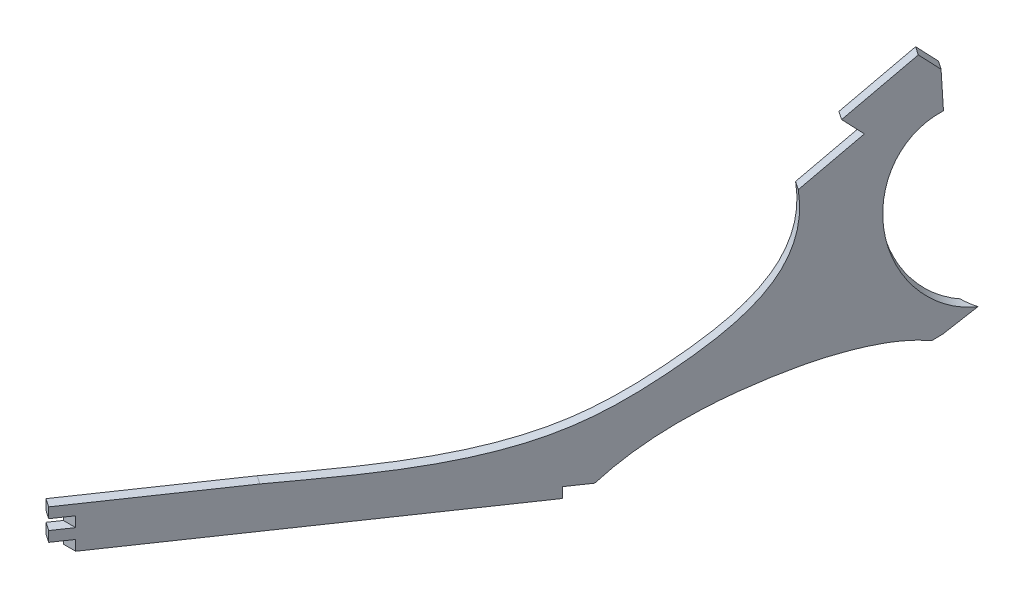
ISO-10303-21;
HEADER;
FILE_DESCRIPTION(('STEP AP214'),'2;1');
FILE_NAME('part.step','',(''),(''),'','','');
FILE_SCHEMA(('AUTOMOTIVE_DESIGN { 1 0 10303 214 1 1 1 1 }'));
ENDSEC;
DATA;
#1=APPLICATION_CONTEXT('core data for automotive mechanical design processes');
#2=APPLICATION_PROTOCOL_DEFINITION('international standard','automotive_design',2000,#1);
#3=PRODUCT_CONTEXT('',#1,'mechanical');
#4=PRODUCT('Part','Part','',(#3));
#5=PRODUCT_RELATED_PRODUCT_CATEGORY('part','',(#4));
#6=PRODUCT_DEFINITION_FORMATION('','',#4);
#7=PRODUCT_DEFINITION_CONTEXT('part definition',#1,'design');
#8=PRODUCT_DEFINITION('design','',#6,#7);
#9=PRODUCT_DEFINITION_SHAPE('','',#8);
#10=(LENGTH_UNIT() NAMED_UNIT(*) SI_UNIT(.MILLI.,.METRE.));
#11=(NAMED_UNIT(*) PLANE_ANGLE_UNIT() SI_UNIT($,.RADIAN.));
#12=(NAMED_UNIT(*) SI_UNIT($,.STERADIAN.) SOLID_ANGLE_UNIT());
#13=UNCERTAINTY_MEASURE_WITH_UNIT(LENGTH_MEASURE(1.E-05),#10,'distance_accuracy_value','');
#14=(GEOMETRIC_REPRESENTATION_CONTEXT(3) GLOBAL_UNCERTAINTY_ASSIGNED_CONTEXT((#13)) GLOBAL_UNIT_ASSIGNED_CONTEXT((#10,
#11,#12)) REPRESENTATION_CONTEXT('',''));
#15=CARTESIAN_POINT('',(0.,0.,0.));
#16=DIRECTION('',(0.,0.,1.));
#17=DIRECTION('',(1.,0.,0.));
#18=AXIS2_PLACEMENT_3D('',#15,#16,#17);
#19=CARTESIAN_POINT('',(-398.183071720413,-148.031926349393,-380.609368558991));
#20=CARTESIAN_POINT('',(-378.854778100143,-114.518844889762,-408.876006948521));
#21=CARTESIAN_POINT('',(-332.192983602547,-70.6098253840643,-477.116488885679));
#22=CARTESIAN_POINT('',(-280.597357775185,-49.9389353274737,-552.5724461676));
#23=CARTESIAN_POINT('',(-254.871422759743,-59.5684170689204,-590.195307067822));
#24=B_SPLINE_CURVE_WITH_KNOTS('',3,(#19,#20,#21,#22,#23),.UNSPECIFIED.,.F.,.F.,(4,1,4),(0.,
0.513639288530766,1.),.UNSPECIFIED.);
#25=DIRECTION('',(0.825471058932899,0.,0.564444444444445));
#26=VECTOR('',#25,1.);
#27=SURFACE_OF_LINEAR_EXTRUSION('',#24,#26);
#28=CARTESIAN_POINT('',(-328.735302333193,-74.9717549054729,-482.173170454537));
#29=VERTEX_POINT('',#28);
#30=CARTESIAN_POINT('',(-283.86486541538,-56.3350215880842,-547.793883780516));
#31=VERTEX_POINT('',#30);
#32=EDGE_CURVE('E399',#29,#31,#24,.T.);
#33=ORIENTED_EDGE('',*,*,#32,.T.);
#34=DIRECTION('',(-0.8254710589329,0.,-0.564444444444445));
#35=VECTOR('',#34,1.);
#36=CARTESIAN_POINT('',(-275.610154826264,-56.3350215881099,-542.149439335757));
#37=LINE('',#36,#35);
#38=CARTESIAN_POINT('',(-275.610154502813,-56.3350215460951,-542.149439808786));
#39=VERTEX_POINT('',#38);
#40=EDGE_CURVE('E217',#31,#39,#37,.F.);
#41=ORIENTED_EDGE('',*,*,#40,.T.);
#42=CARTESIAN_POINT('',(-389.928361131084,-148.031926349393,-374.964924114547));
#43=CARTESIAN_POINT('',(-370.600067510814,-114.518844889762,-403.231562504076));
#44=CARTESIAN_POINT('',(-323.938273013218,-70.6098253840643,-471.472044441234));
#45=CARTESIAN_POINT('',(-272.342647185856,-49.9389353274737,-546.928001723156));
#46=CARTESIAN_POINT('',(-246.616712170414,-59.5684170689204,-584.550862623378));
#47=B_SPLINE_CURVE_WITH_KNOTS('',3,(#42,#43,#44,#45,#46),.UNSPECIFIED.,.F.,.F.,(4,1,4),(0.,
0.513639288530766,1.),.UNSPECIFIED.);
#48=CARTESIAN_POINT('',(-320.480588799482,-74.971753011851,-476.5287303161));
#49=VERTEX_POINT('',#48);
#50=EDGE_CURVE('E406',#49,#39,#47,.T.);
#51=ORIENTED_EDGE('',*,*,#50,.F.);
#52=DIRECTION('',(-0.8254710589329,0.,-0.564444444444445));
#53=VECTOR('',#52,1.);
#54=CARTESIAN_POINT('',(-320.480592013499,-74.971755079755,-476.528725615765));
#55=LINE('',#54,#53);
#56=EDGE_CURVE('E232',#49,#29,#55,.T.);
#57=ORIENTED_EDGE('',*,*,#56,.T.);
#58=EDGE_LOOP('',(#33,#41,#51,#57));
#59=FACE_BOUND('',#58,.T.);
#60=ADVANCED_FACE('F32',(#59),#27,.T.);
#61=CARTESIAN_POINT('',(-621.960086718888,-118.031926349393,-74.2955423936231));
#62=DIRECTION('',(0.,0.,-1.));
#63=DIRECTION('',(1.,0.,0.));
#64=AXIS2_PLACEMENT_3D('',#61,#62,#63);
#65=PLANE('',#64);
#66=DIRECTION('',(0.,1.,0.));
#67=VECTOR('',#66,1.);
#68=CARTESIAN_POINT('',(-595.521471017104,-118.031926349393,-74.2955423936232));
#69=LINE('',#68,#67);
#70=CARTESIAN_POINT('',(-595.521471017104,-158.031926349393,-74.2955423936248));
#71=VERTEX_POINT('',#70);
#72=CARTESIAN_POINT('',(-595.521471017104,-148.031926349393,-74.2955423936232));
#73=VERTEX_POINT('',#72);
#74=EDGE_CURVE('E297',#71,#73,#69,.T.);
#75=ORIENTED_EDGE('',*,*,#74,.T.);
#76=DIRECTION('',(-1.,0.,0.));
#77=VECTOR('',#76,1.);
#78=CARTESIAN_POINT('',(-621.960086718888,-148.031926349393,-74.2955423936231));
#79=LINE('',#78,#77);
#80=CARTESIAN_POINT('',(-607.635766111747,-148.031926349393,-74.2955423936232));
#81=VERTEX_POINT('',#80);
#82=EDGE_CURVE('E46',#73,#81,#79,.T.);
#83=ORIENTED_EDGE('',*,*,#82,.T.);
#84=DIRECTION('',(0.,1.,0.));
#85=VECTOR('',#84,1.);
#86=CARTESIAN_POINT('',(-607.635766111747,-91.4048145856407,-74.2955423936232));
#87=LINE('',#86,#85);
#88=CARTESIAN_POINT('',(-607.635766111746,-158.031926349393,-74.2955423936248));
#89=VERTEX_POINT('',#88);
#90=EDGE_CURVE('E300',#89,#81,#87,.T.);
#91=ORIENTED_EDGE('',*,*,#90,.F.);
#92=DIRECTION('',(1.,0.,0.));
#93=VECTOR('',#92,1.);
#94=CARTESIAN_POINT('',(-614.473612676278,-158.031926349393,-74.2955423936248));
#95=LINE('',#94,#93);
#96=EDGE_CURVE('E275',#89,#71,#95,.T.);
#97=ORIENTED_EDGE('',*,*,#96,.T.);
#98=EDGE_LOOP('',(#75,#83,#91,#97));
#99=FACE_BOUND('',#98,.T.);
#100=ADVANCED_FACE('F371',(#99),#65,.F.);
#101=CARTESIAN_POINT('',(-398.678380572576,-91.4048145856407,-379.885004758943));
#102=DIRECTION('',(-0.825471058932899,0.,-0.564444444444445));
#103=DIRECTION('',(0.564444444444444,0.,-0.8254710589329));
#104=AXIS2_PLACEMENT_3D('',#101,#102,#103);
#105=PLANE('',#104);
#106=DIRECTION('',(0.438722613160506,0.629174014368903,-0.641609326883997));
#107=VECTOR('',#106,1.);
#108=CARTESIAN_POINT('',(-356.955288965003,-182.72216842397,-440.902886944243));
#109=LINE('',#108,#107);
#110=CARTESIAN_POINT('',(-269.294497833259,-57.0074452585899,-569.102299295609));
#111=VERTEX_POINT('',#110);
#112=CARTESIAN_POINT('',(-252.502935274898,-32.9265921074138,-593.65909857366));
#113=VERTEX_POINT('',#112);
#114=EDGE_CURVE('E198',#111,#113,#109,.T.);
#115=ORIENTED_EDGE('',*,*,#114,.F.);
#116=CARTESIAN_POINT('',(-264.59658404796,-58.4872229629241,-575.97275732729));
#117=CARTESIAN_POINT('',(-273.633733662373,-54.9344227812588,-562.756389382901));
#118=CARTESIAN_POINT('',(-300.147591392578,-56.822911893129,-523.981231911929));
#119=CARTESIAN_POINT('',(-325.4895775347,-72.0678575008078,-486.919876552518));
#120=CARTESIAN_POINT('',(-341.364287020344,-83.7151520239362,-463.703927882381));
#121=B_SPLINE_CURVE_WITH_KNOTS('',3,(#116,#117,#118,#119,#120),.UNSPECIFIED.,.F.,.F.,(4,1,4),
(0.,0.344916683017439,1.),.UNSPECIFIED.);
#122=EDGE_CURVE('E206',#111,#31,#121,.T.);
#123=ORIENTED_EDGE('',*,*,#122,.T.);
#124=ORIENTED_EDGE('',*,*,#32,.F.);
#125=CARTESIAN_POINT('',(-341.364287020344,-83.7151520239366,-463.703927882381));
#126=VERTEX_POINT('',#125);
#127=EDGE_CURVE('E60',#29,#126,#121,.T.);
#128=ORIENTED_EDGE('',*,*,#127,.T.);
#129=CARTESIAN_POINT('',(-398.183071720413,-148.031926349393,-380.609368558991));
#130=VERTEX_POINT('',#129);
#131=EDGE_CURVE('E393',#130,#126,#24,.T.);
#132=ORIENTED_EDGE('',*,*,#131,.F.);
#133=DIRECTION('',(-0.564444444444444,0.,0.8254710589329));
#134=VECTOR('',#133,1.);
#135=CARTESIAN_POINT('',(-398.183071720413,-148.031926349393,-380.609368558991));
#136=LINE('',#135,#134);
#137=CARTESIAN_POINT('',(-410.952916366542,-148.031926349393,-361.934125519219));
#138=VERTEX_POINT('',#137);
#139=EDGE_CURVE('E281',#130,#138,#136,.T.);
#140=ORIENTED_EDGE('',*,*,#139,.T.);
#141=DIRECTION('',(0.,-1.,0.));
#142=VECTOR('',#141,1.);
#143=CARTESIAN_POINT('',(-410.952916366542,-148.031926349393,-361.934125519219));
#144=LINE('',#143,#142);
#145=CARTESIAN_POINT('',(-410.952916366542,-158.031926349393,-361.934125519219));
#146=VERTEX_POINT('',#145);
#147=EDGE_CURVE('E288',#138,#146,#144,.T.);
#148=ORIENTED_EDGE('',*,*,#147,.T.);
#149=DIRECTION('',(0.564444444444444,0.,-0.8254710589329));
#150=VECTOR('',#149,1.);
#151=CARTESIAN_POINT('',(-614.473612676278,-158.031926349393,-64.295542393623));
#152=LINE('',#151,#150);
#153=EDGE_CURVE('E433',#89,#146,#152,.T.);
#154=ORIENTED_EDGE('',*,*,#153,.F.);
#155=ORIENTED_EDGE('',*,*,#90,.T.);
#156=DIRECTION('',(0.564444444444446,0.,-0.825471058932898));
#157=VECTOR('',#156,1.);
#158=CARTESIAN_POINT('',(-614.473612676279,-148.031926349393,-64.2955423936231));
#159=LINE('',#158,#157);
#160=CARTESIAN_POINT('',(-614.473612676279,-148.031926349393,-64.2955423936231));
#161=VERTEX_POINT('',#160);
#162=EDGE_CURVE('E246',#161,#81,#159,.T.);
#163=ORIENTED_EDGE('',*,*,#162,.F.);
#164=DIRECTION('',(0.,-1.,0.));
#165=VECTOR('',#164,1.);
#166=CARTESIAN_POINT('',(-614.473612676279,-138.031926349393,-64.2955423936231));
#167=LINE('',#166,#165);
#168=CARTESIAN_POINT('',(-614.473612676279,-138.031926349393,-64.2955423936231));
#169=VERTEX_POINT('',#168);
#170=EDGE_CURVE('E242',#169,#161,#167,.T.);
#171=ORIENTED_EDGE('',*,*,#170,.F.);
#172=DIRECTION('',(-0.564444444444443,0.,0.825471058932901));
#173=VECTOR('',#172,1.);
#174=CARTESIAN_POINT('',(-603.776181606433,-138.031926349393,-79.9399868380684));
#175=LINE('',#174,#173);
#176=CARTESIAN_POINT('',(-607.635766111747,-138.031926349393,-74.2955423936232));
#177=VERTEX_POINT('',#176);
#178=EDGE_CURVE('E240',#177,#169,#175,.T.);
#179=ORIENTED_EDGE('',*,*,#178,.F.);
#180=CARTESIAN_POINT('',(-607.635766111747,-128.031926349393,-74.2955423936232));
#181=VERTEX_POINT('',#180);
#182=EDGE_CURVE('E299',#177,#181,#87,.T.);
#183=ORIENTED_EDGE('',*,*,#182,.T.);
#184=DIRECTION('',(0.564444444444445,0.,-0.825471058932899));
#185=VECTOR('',#184,1.);
#186=CARTESIAN_POINT('',(-603.776181606433,-128.031926349393,-79.9399868380681));
#187=LINE('',#186,#185);
#188=CARTESIAN_POINT('',(-614.473612676279,-128.031926349393,-64.2955423936231));
#189=VERTEX_POINT('',#188);
#190=EDGE_CURVE('E264',#189,#181,#187,.T.);
#191=ORIENTED_EDGE('',*,*,#190,.F.);
#192=DIRECTION('',(0.,-1.,0.));
#193=VECTOR('',#192,1.);
#194=CARTESIAN_POINT('',(-614.473612676279,-128.031926349393,-64.2955423936231));
#195=LINE('',#194,#193);
#196=CARTESIAN_POINT('',(-614.473612676279,-118.031926349393,-64.295542393623));
#197=VERTEX_POINT('',#196);
#198=EDGE_CURVE('E261',#197,#189,#195,.T.);
#199=ORIENTED_EDGE('',*,*,#198,.F.);
#200=DIRECTION('',(-0.564444444444444,0.,0.8254710589329));
#201=VECTOR('',#200,1.);
#202=CARTESIAN_POINT('',(-530.843248617894,-118.031926349393,-186.600661803852));
#203=LINE('',#202,#201);
#204=CARTESIAN_POINT('',(-530.843248617894,-118.031926349393,-186.600661803852));
#205=VERTEX_POINT('',#204);
#206=EDGE_CURVE('E445',#205,#197,#203,.T.);
#207=ORIENTED_EDGE('',*,*,#206,.F.);
#208=CARTESIAN_POINT('',(-317.575035290969,81.2771901046705,-498.494488777345));
#209=CARTESIAN_POINT('',(-312.939038061973,17.2026348476018,-505.274397020744));
#210=CARTESIAN_POINT('',(-351.092491140239,-44.255191332768,-449.476928156536));
#211=CARTESIAN_POINT('',(-427.980364948885,-125.219604065018,-337.032355025179));
#212=CARTESIAN_POINT('',(-491.068185036995,-119.331018895481,-244.769652882442));
#213=CARTESIAN_POINT('',(-530.843248617894,-118.031926349393,-186.600661803852));
#214=B_SPLINE_CURVE_WITH_KNOTS('',3,(#208,#209,#210,#211,#212,#213),.UNSPECIFIED.,.F.,.F.,(4,1,
1,4),(0.,0.356407170334646,0.531921689294259,1.),.UNSPECIFIED.);
#215=CARTESIAN_POINT('',(-317.575035290969,81.2771901046705,-498.494488777345));
#216=VERTEX_POINT('',#215);
#217=EDGE_CURVE('E455',#216,#205,#214,.T.);
#218=ORIENTED_EDGE('',*,*,#217,.F.);
#219=DIRECTION('',(-0.42280515679162,-0.66249735330954,0.618330863088903));
#220=VECTOR('',#219,1.);
#221=CARTESIAN_POINT('',(-291.385939341985,122.313129409267,-536.794698794969));
#222=LINE('',#221,#220);
#223=CARTESIAN_POINT('',(-291.385939341985,122.313129409267,-536.794698794969));
#224=VERTEX_POINT('',#223);
#225=EDGE_CURVE('E459',#224,#216,#222,.T.);
#226=ORIENTED_EDGE('',*,*,#225,.F.);
#227=DIRECTION('',(0.422805156791622,-0.662497353309537,-0.618330863088906));
#228=VECTOR('',#227,1.);
#229=CARTESIAN_POINT('',(-300.411436334372,136.455265032998,-523.59537221282));
#230=LINE('',#229,#228);
#231=CARTESIAN_POINT('',(-300.411436334372,136.455265032998,-523.59537221282));
#232=VERTEX_POINT('',#231);
#233=EDGE_CURVE('E483',#232,#224,#230,.T.);
#234=ORIENTED_EDGE('',*,*,#233,.F.);
#235=DIRECTION('',(-0.422805156791621,-0.662497353309539,0.618330863088904));
#236=VECTOR('',#235,1.);
#237=CARTESIAN_POINT('',(-270.04273027971,184.040274490593,-568.008047706575));
#238=LINE('',#237,#236);
#239=CARTESIAN_POINT('',(-270.04273027971,184.040274490593,-568.008047706575));
#240=VERTEX_POINT('',#239);
#241=EDGE_CURVE('E478',#240,#232,#238,.T.);
#242=ORIENTED_EDGE('',*,*,#241,.F.);
#243=DIRECTION('',(-0.42280515679162,0.662497353309542,0.618330863088902));
#244=VECTOR('',#243,1.);
#245=CARTESIAN_POINT('',(-261.017233287322,169.898138866862,-581.207374288724));
#246=LINE('',#245,#244);
#247=CARTESIAN_POINT('',(-261.017233287322,169.898138866862,-581.207374288724));
#248=VERTEX_POINT('',#247);
#249=EDGE_CURVE('E474',#248,#240,#246,.T.);
#250=ORIENTED_EDGE('',*,*,#249,.F.);
#251=DIRECTION('',(-0.0267529332768503,0.998876134021714,0.0391247931996901));
#252=VECTOR('',#251,1.);
#253=CARTESIAN_POINT('',(-261.017233287322,169.898138866862,-581.207374288724));
#254=LINE('',#253,#252);
#255=CARTESIAN_POINT('',(-260.070248531117,134.54050303431,-582.592290939409));
#256=VERTEX_POINT('',#255);
#257=EDGE_CURVE('E398',#256,#248,#254,.T.);
#258=ORIENTED_EDGE('',*,*,#257,.F.);
#259=CARTESIAN_POINT('',(-246.615072400581,53.1674881884685,-602.269796135752));
#260=DIRECTION('',(0.825471058932899,0.,0.564444444444445));
#261=DIRECTION('',(0.,-1.,0.));
#262=AXIS2_PLACEMENT_3D('',#259,#260,#261);
#263=ELLIPSE('',#262,87.1747624692816,66.4535254185836);
#264=EDGE_CURVE('E209',#256,#113,#263,.T.);
#265=ORIENTED_EDGE('',*,*,#264,.T.);
#266=EDGE_LOOP('',(#115,#123,#124,#128,#132,#140,#148,#154,#155,#163,#171,#179,#183,#191,#199,
#207,#218,#226,#234,#242,#250,#258,#265));
#267=FACE_BOUND('',#266,.T.);
#268=ADVANCED_FACE('F205',(#267),#105,.T.);
#269=CARTESIAN_POINT('',(-390.423669983247,-91.4048145856407,-374.240560314498));
#270=DIRECTION('',(-0.825471058932899,0.,-0.564444444444445));
#271=DIRECTION('',(0.564444444444444,0.,-0.8254710589329));
#272=AXIS2_PLACEMENT_3D('',#269,#270,#271);
#273=PLANE('',#272);
#274=DIRECTION('',(-0.485001181270514,-0.511549076950684,0.709289359878681));
#275=VECTOR('',#274,1.);
#276=CARTESIAN_POINT('',(-256.341873458631,-58.4872229629241,-570.328312882845));
#277=LINE('',#276,#275);
#278=CARTESIAN_POINT('',(-252.051208630587,-53.9616965991716,-576.603190196268));
#279=VERTEX_POINT('',#278);
#280=CARTESIAN_POINT('',(-256.341873458631,-58.4872229629241,-570.328312882845));
#281=VERTEX_POINT('',#280);
#282=EDGE_CURVE('E226',#279,#281,#277,.T.);
#283=ORIENTED_EDGE('',*,*,#282,.F.);
#284=DIRECTION('',(0.438722613160506,0.629174014368903,-0.641609326883997));
#285=VECTOR('',#284,1.);
#286=CARTESIAN_POINT('',(-345.983086919177,-188.669813225068,-439.232634419506));
#287=LINE('',#286,#285);
#288=CARTESIAN_POINT('',(-238.135915235411,-34.0057136068821,-596.953593300303));
#289=VERTEX_POINT('',#288);
#290=EDGE_CURVE('E211',#279,#289,#287,.T.);
#291=ORIENTED_EDGE('',*,*,#290,.T.);
#292=CARTESIAN_POINT('',(-238.360361811252,53.1674881884685,-596.625351691307));
#293=DIRECTION('',(0.825471058932899,0.,0.564444444444445));
#294=DIRECTION('',(0.,-1.,0.));
#295=AXIS2_PLACEMENT_3D('',#292,#293,#294);
#296=ELLIPSE('',#295,87.1747624692816,66.4535254185836);
#297=CARTESIAN_POINT('',(-251.815537941788,134.54050303431,-576.947846494965));
#298=VERTEX_POINT('',#297);
#299=EDGE_CURVE('E303',#298,#289,#296,.T.);
#300=ORIENTED_EDGE('',*,*,#299,.F.);
#301=DIRECTION('',(-0.0267529332768503,0.998876134021714,0.0391247931996901));
#302=VECTOR('',#301,1.);
#303=CARTESIAN_POINT('',(-252.762522697993,169.898138866862,-575.56292984428));
#304=LINE('',#303,#302);
#305=CARTESIAN_POINT('',(-252.762522697993,169.898138866862,-575.56292984428));
#306=VERTEX_POINT('',#305);
#307=EDGE_CURVE('E410',#298,#306,#304,.T.);
#308=ORIENTED_EDGE('',*,*,#307,.T.);
#309=DIRECTION('',(-0.42280515679162,0.662497353309542,0.618330863088902));
#310=VECTOR('',#309,1.);
#311=CARTESIAN_POINT('',(-252.762522697993,169.898138866862,-575.56292984428));
#312=LINE('',#311,#310);
#313=CARTESIAN_POINT('',(-261.788019690381,184.040274490593,-562.363603262131));
#314=VERTEX_POINT('',#313);
#315=EDGE_CURVE('E500',#306,#314,#312,.T.);
#316=ORIENTED_EDGE('',*,*,#315,.T.);
#317=DIRECTION('',(-0.422805156791621,-0.662497353309539,0.618330863088904));
#318=VECTOR('',#317,1.);
#319=CARTESIAN_POINT('',(-261.788019690381,184.040274490593,-562.363603262131));
#320=LINE('',#319,#318);
#321=CARTESIAN_POINT('',(-292.156725745043,136.455265032998,-517.950927768375));
#322=VERTEX_POINT('',#321);
#323=EDGE_CURVE('E504',#314,#322,#320,.T.);
#324=ORIENTED_EDGE('',*,*,#323,.T.);
#325=DIRECTION('',(0.422805156791622,-0.662497353309537,-0.618330863088906));
#326=VECTOR('',#325,1.);
#327=CARTESIAN_POINT('',(-292.156725745043,136.455265032998,-517.950927768375));
#328=LINE('',#327,#326);
#329=CARTESIAN_POINT('',(-283.131228752656,122.313129409267,-531.150254350524));
#330=VERTEX_POINT('',#329);
#331=EDGE_CURVE('E508',#322,#330,#328,.T.);
#332=ORIENTED_EDGE('',*,*,#331,.T.);
#333=DIRECTION('',(-0.42280515679162,-0.66249735330954,0.618330863088903));
#334=VECTOR('',#333,1.);
#335=CARTESIAN_POINT('',(-283.131228752656,122.313129409267,-531.150254350524));
#336=LINE('',#335,#334);
#337=CARTESIAN_POINT('',(-309.32032470164,81.2771901046705,-492.850044332901));
#338=VERTEX_POINT('',#337);
#339=EDGE_CURVE('E512',#330,#338,#336,.T.);
#340=ORIENTED_EDGE('',*,*,#339,.T.);
#341=CARTESIAN_POINT('',(-309.32032470164,81.2771901046705,-492.850044332901));
#342=CARTESIAN_POINT('',(-304.684327472644,17.2026348476018,-499.629952576299));
#343=CARTESIAN_POINT('',(-342.837780550911,-44.255191332768,-443.832483712092));
#344=CARTESIAN_POINT('',(-419.725654359556,-125.219604065018,-331.387910580734));
#345=CARTESIAN_POINT('',(-482.813474447666,-119.331018895481,-239.125208437997));
#346=CARTESIAN_POINT('',(-522.588538028565,-118.031926349393,-180.956217359408));
#347=B_SPLINE_CURVE_WITH_KNOTS('',3,(#341,#342,#343,#344,#345,#346),.UNSPECIFIED.,.F.,.F.,(4,1,
1,4),(0.,0.356407170334646,0.531921689294259,1.),.UNSPECIFIED.);
#348=CARTESIAN_POINT('',(-522.588538028565,-118.031926349393,-180.956217359408));
#349=VERTEX_POINT('',#348);
#350=EDGE_CURVE('E457',#338,#349,#347,.T.);
#351=ORIENTED_EDGE('',*,*,#350,.T.);
#352=DIRECTION('',(-0.564444444444444,0.,0.8254710589329));
#353=VECTOR('',#352,1.);
#354=CARTESIAN_POINT('',(-522.588538028565,-118.031926349393,-180.956217359408));
#355=LINE('',#354,#353);
#356=CARTESIAN_POINT('',(-606.21890208695,-118.031926349393,-58.6510979491785));
#357=VERTEX_POINT('',#356);
#358=EDGE_CURVE('E451',#349,#357,#355,.T.);
#359=ORIENTED_EDGE('',*,*,#358,.T.);
#360=DIRECTION('',(0.,-1.,0.));
#361=VECTOR('',#360,1.);
#362=CARTESIAN_POINT('',(-606.218902086949,-128.031926349393,-58.6510979491787));
#363=LINE('',#362,#361);
#364=CARTESIAN_POINT('',(-606.218902086949,-128.031926349393,-58.6510979491787));
#365=VERTEX_POINT('',#364);
#366=EDGE_CURVE('E259',#357,#365,#363,.T.);
#367=ORIENTED_EDGE('',*,*,#366,.T.);
#368=DIRECTION('',(0.564444444444445,0.,-0.825471058932899));
#369=VECTOR('',#368,1.);
#370=CARTESIAN_POINT('',(-595.521471017104,-128.031926349393,-74.2955423936236));
#371=LINE('',#370,#369);
#372=CARTESIAN_POINT('',(-595.521471017104,-128.031926349393,-74.2955423936232));
#373=VERTEX_POINT('',#372);
#374=EDGE_CURVE('E265',#365,#373,#371,.T.);
#375=ORIENTED_EDGE('',*,*,#374,.T.);
#376=CARTESIAN_POINT('',(-595.521471017104,-138.031926349393,-74.295542393624));
#377=VERTEX_POINT('',#376);
#378=EDGE_CURVE('E294',#377,#373,#69,.T.);
#379=ORIENTED_EDGE('',*,*,#378,.F.);
#380=DIRECTION('',(-0.564444444444443,0.,0.825471058932901));
#381=VECTOR('',#380,1.);
#382=CARTESIAN_POINT('',(-595.521471017104,-138.031926349393,-74.295542393624));
#383=LINE('',#382,#381);
#384=CARTESIAN_POINT('',(-606.218902086949,-138.031926349393,-58.6510979491786));
#385=VERTEX_POINT('',#384);
#386=EDGE_CURVE('E239',#377,#385,#383,.T.);
#387=ORIENTED_EDGE('',*,*,#386,.T.);
#388=DIRECTION('',(0.,-1.,0.));
#389=VECTOR('',#388,1.);
#390=CARTESIAN_POINT('',(-606.218902086949,-138.031926349393,-58.6510979491786));
#391=LINE('',#390,#389);
#392=CARTESIAN_POINT('',(-606.218902086949,-148.031926349393,-58.6510979491787));
#393=VERTEX_POINT('',#392);
#394=EDGE_CURVE('E252',#385,#393,#391,.T.);
#395=ORIENTED_EDGE('',*,*,#394,.T.);
#396=DIRECTION('',(0.564444444444446,0.,-0.825471058932898));
#397=VECTOR('',#396,1.);
#398=CARTESIAN_POINT('',(-606.218902086949,-148.031926349393,-58.6510979491787));
#399=LINE('',#398,#397);
#400=EDGE_CURVE('E243',#393,#73,#399,.T.);
#401=ORIENTED_EDGE('',*,*,#400,.T.);
#402=ORIENTED_EDGE('',*,*,#74,.F.);
#403=DIRECTION('',(0.564444444444444,0.,-0.8254710589329));
#404=VECTOR('',#403,1.);
#405=CARTESIAN_POINT('',(-606.218902086949,-158.031926349393,-58.6510979491786));
#406=LINE('',#405,#404);
#407=CARTESIAN_POINT('',(-402.698205777213,-158.031926349393,-356.289681074775));
#408=VERTEX_POINT('',#407);
#409=EDGE_CURVE('E498',#71,#408,#406,.T.);
#410=ORIENTED_EDGE('',*,*,#409,.T.);
#411=DIRECTION('',(0.,-1.,0.));
#412=VECTOR('',#411,1.);
#413=CARTESIAN_POINT('',(-402.698205777213,-148.031926349393,-356.289681074775));
#414=LINE('',#413,#412);
#415=CARTESIAN_POINT('',(-402.698205777213,-148.031926349393,-356.289681074775));
#416=VERTEX_POINT('',#415);
#417=EDGE_CURVE('E291',#416,#408,#414,.T.);
#418=ORIENTED_EDGE('',*,*,#417,.F.);
#419=DIRECTION('',(0.564444444444444,0.,-0.8254710589329));
#420=VECTOR('',#419,1.);
#421=CARTESIAN_POINT('',(-402.698205777213,-148.031926349393,-356.289681074775));
#422=LINE('',#421,#420);
#423=CARTESIAN_POINT('',(-389.928361131084,-148.031926349393,-374.964924114547));
#424=VERTEX_POINT('',#423);
#425=EDGE_CURVE('E286',#416,#424,#422,.T.);
#426=ORIENTED_EDGE('',*,*,#425,.T.);
#427=CARTESIAN_POINT('',(-333.109576431015,-83.7151520239366,-458.059483437936));
#428=VERTEX_POINT('',#427);
#429=EDGE_CURVE('E407',#424,#428,#47,.T.);
#430=ORIENTED_EDGE('',*,*,#429,.T.);
#431=CARTESIAN_POINT('',(-256.341873458631,-58.4872229629241,-570.328312882845));
#432=CARTESIAN_POINT('',(-265.379023073044,-54.9344227812588,-557.111944938457));
#433=CARTESIAN_POINT('',(-291.892880803249,-56.822911893129,-518.336787467484));
#434=CARTESIAN_POINT('',(-317.234866945371,-72.0678575008078,-481.275432108074));
#435=CARTESIAN_POINT('',(-333.109576431015,-83.7151520239362,-458.059483437937));
#436=B_SPLINE_CURVE_WITH_KNOTS('',3,(#431,#432,#433,#434,#435),.UNSPECIFIED.,.F.,.F.,(4,1,4),
(0.,0.344916683017439,1.),.UNSPECIFIED.);
#437=EDGE_CURVE('E218',#49,#428,#436,.T.);
#438=ORIENTED_EDGE('',*,*,#437,.F.);
#439=ORIENTED_EDGE('',*,*,#50,.T.);
#440=EDGE_CURVE('E220',#281,#39,#436,.T.);
#441=ORIENTED_EDGE('',*,*,#440,.F.);
#442=EDGE_LOOP('',(#283,#291,#300,#308,#316,#324,#332,#340,#351,#359,#367,#375,#379,#387,#395,
#401,#402,#410,#418,#426,#430,#438,#439,#441));
#443=FACE_BOUND('',#442,.T.);
#444=ADVANCED_FACE('F388',(#443),#273,.F.);
#445=CARTESIAN_POINT('',(-614.473612676278,-158.031926349393,-64.295542393623));
#446=DIRECTION('',(0.,1.,0.));
#447=DIRECTION('',(-0.825471058932899,0.,-0.564444444444445));
#448=AXIS2_PLACEMENT_3D('',#445,#446,#447);
#449=PLANE('',#448);
#450=ORIENTED_EDGE('',*,*,#96,.F.);
#451=ORIENTED_EDGE('',*,*,#153,.T.);
#452=DIRECTION('',(0.825471058932896,0.,0.564444444444449));
#453=VECTOR('',#452,1.);
#454=CARTESIAN_POINT('',(-410.952916366542,-158.031926349393,-361.934125519219));
#455=LINE('',#454,#453);
#456=EDGE_CURVE('E280',#146,#408,#455,.T.);
#457=ORIENTED_EDGE('',*,*,#456,.T.);
#458=ORIENTED_EDGE('',*,*,#409,.F.);
#459=EDGE_LOOP('',(#450,#451,#457,#458));
#460=FACE_BOUND('',#459,.T.);
#461=ADVANCED_FACE('F381',(#460),#449,.F.);
#462=ORIENTED_EDGE('',*,*,#131,.T.);
#463=DIRECTION('',(-0.8254710589329,0.,-0.564444444444445));
#464=VECTOR('',#463,1.);
#465=CARTESIAN_POINT('',(-333.109576431015,-83.7151520239361,-458.059483437937));
#466=LINE('',#465,#464);
#467=EDGE_CURVE('E233',#428,#126,#466,.T.);
#468=ORIENTED_EDGE('',*,*,#467,.F.);
#469=ORIENTED_EDGE('',*,*,#429,.F.);
#470=DIRECTION('',(0.825471058932899,0.,0.564444444444445));
#471=VECTOR('',#470,1.);
#472=CARTESIAN_POINT('',(-398.183071720413,-148.031926349393,-380.609368558991));
#473=LINE('',#472,#471);
#474=EDGE_CURVE('E397',#130,#424,#473,.T.);
#475=ORIENTED_EDGE('',*,*,#474,.F.);
#476=EDGE_LOOP('',(#462,#468,#469,#475));
#477=FACE_BOUND('',#476,.T.);
#478=ADVANCED_FACE('F34',(#477),#27,.T.);
#479=CARTESIAN_POINT('',(-261.017233287322,169.898138866862,-581.207374288724));
#480=DIRECTION('',(-0.563810084536701,-0.0473969290337899,0.824543340093705));
#481=DIRECTION('',(0.0267529332768503,-0.998876134021714,-0.0391247931996901));
#482=AXIS2_PLACEMENT_3D('',#479,#480,#481);
#483=PLANE('',#482);
#484=ORIENTED_EDGE('',*,*,#257,.T.);
#485=DIRECTION('',(0.825471058932899,0.,0.564444444444445));
#486=VECTOR('',#485,1.);
#487=CARTESIAN_POINT('',(-261.017233287322,169.898138866862,-581.207374288724));
#488=LINE('',#487,#486);
#489=EDGE_CURVE('E503',#248,#306,#488,.T.);
#490=ORIENTED_EDGE('',*,*,#489,.T.);
#491=ORIENTED_EDGE('',*,*,#307,.F.);
#492=DIRECTION('',(-0.825471058932899,0.,-0.564444444444445));
#493=VECTOR('',#492,1.);
#494=CARTESIAN_POINT('',(-251.815537941788,134.54050303431,-576.947846494965));
#495=LINE('',#494,#493);
#496=EDGE_CURVE('E307',#256,#298,#495,.F.);
#497=ORIENTED_EDGE('',*,*,#496,.F.);
#498=EDGE_LOOP('',(#484,#490,#491,#497));
#499=FACE_BOUND('',#498,.T.);
#500=ADVANCED_FACE('F380',(#499),#483,.F.);
#501=DIRECTION('',(0.825471058932899,0.,0.564444444444445));
#502=VECTOR('',#501,1.);
#503=SURFACE_OF_LINEAR_EXTRUSION('',#214,#502);
#504=ORIENTED_EDGE('',*,*,#350,.F.);
#505=DIRECTION('',(0.825471058932899,0.,0.564444444444445));
#506=VECTOR('',#505,1.);
#507=CARTESIAN_POINT('',(-317.575035290969,81.2771901046705,-498.494488777345));
#508=LINE('',#507,#506);
#509=EDGE_CURVE('E493',#216,#338,#508,.T.);
#510=ORIENTED_EDGE('',*,*,#509,.F.);
#511=ORIENTED_EDGE('',*,*,#217,.T.);
#512=DIRECTION('',(0.825471058932899,0.,0.564444444444445));
#513=VECTOR('',#512,1.);
#514=CARTESIAN_POINT('',(-530.843248617894,-118.031926349393,-186.600661803852));
#515=LINE('',#514,#513);
#516=EDGE_CURVE('E453',#205,#349,#515,.T.);
#517=ORIENTED_EDGE('',*,*,#516,.T.);
#518=EDGE_LOOP('',(#504,#510,#511,#517));
#519=FACE_BOUND('',#518,.T.);
#520=ADVANCED_FACE('F319',(#519),#503,.T.);
#521=CARTESIAN_POINT('',(-530.843248617894,-118.031926349393,-186.600661803852));
#522=DIRECTION('',(0.,-1.,0.));
#523=DIRECTION('',(0.564444444444444,0.,-0.8254710589329));
#524=AXIS2_PLACEMENT_3D('',#521,#522,#523);
#525=PLANE('',#524);
#526=ORIENTED_EDGE('',*,*,#206,.T.);
#527=DIRECTION('',(0.8254710589329,0.,0.564444444444445));
#528=VECTOR('',#527,1.);
#529=CARTESIAN_POINT('',(-614.473612676279,-118.031926349393,-64.295542393623));
#530=LINE('',#529,#528);
#531=EDGE_CURVE('E268',#197,#357,#530,.T.);
#532=ORIENTED_EDGE('',*,*,#531,.T.);
#533=ORIENTED_EDGE('',*,*,#358,.F.);
#534=ORIENTED_EDGE('',*,*,#516,.F.);
#535=EDGE_LOOP('',(#526,#532,#533,#534));
#536=FACE_BOUND('',#535,.T.);
#537=ADVANCED_FACE('F450',(#536),#525,.F.);
#538=CARTESIAN_POINT('',(-261.017233287322,169.898138866862,-581.207374288724));
#539=DIRECTION('',(-0.373942950534719,-0.749064254158382,0.546872391776671));
#540=DIRECTION('',(0.42280515679162,-0.662497353309542,-0.618330863088902));
#541=AXIS2_PLACEMENT_3D('',#538,#539,#540);
#542=PLANE('',#541);
#543=ORIENTED_EDGE('',*,*,#315,.F.);
#544=ORIENTED_EDGE('',*,*,#489,.F.);
#545=ORIENTED_EDGE('',*,*,#249,.T.);
#546=DIRECTION('',(0.825471058932899,0.,0.564444444444445));
#547=VECTOR('',#546,1.);
#548=CARTESIAN_POINT('',(-270.04273027971,184.040274490593,-568.008047706575));
#549=LINE('',#548,#547);
#550=EDGE_CURVE('E507',#240,#314,#549,.T.);
#551=ORIENTED_EDGE('',*,*,#550,.T.);
#552=EDGE_LOOP('',(#543,#544,#545,#551));
#553=FACE_BOUND('',#552,.T.);
#554=ADVANCED_FACE('F526',(#553),#542,.F.);
#555=CARTESIAN_POINT('',(-270.04273027971,184.040274490593,-568.008047706575));
#556=DIRECTION('',(0.373942950534718,-0.749064254158384,-0.546872391776669));
#557=DIRECTION('',(0.422805156791621,0.662497353309539,-0.618330863088904));
#558=AXIS2_PLACEMENT_3D('',#555,#556,#557);
#559=PLANE('',#558);
#560=ORIENTED_EDGE('',*,*,#323,.F.);
#561=ORIENTED_EDGE('',*,*,#550,.F.);
#562=ORIENTED_EDGE('',*,*,#241,.T.);
#563=DIRECTION('',(0.825471058932899,0.,0.564444444444445));
#564=VECTOR('',#563,1.);
#565=CARTESIAN_POINT('',(-300.411436334372,136.455265032998,-523.59537221282));
#566=LINE('',#565,#564);
#567=EDGE_CURVE('E511',#232,#322,#566,.T.);
#568=ORIENTED_EDGE('',*,*,#567,.T.);
#569=EDGE_LOOP('',(#560,#561,#562,#568));
#570=FACE_BOUND('',#569,.T.);
#571=ADVANCED_FACE('F528',(#570),#559,.F.);
#572=CARTESIAN_POINT('',(-300.411436334372,136.455265032998,-523.59537221282));
#573=DIRECTION('',(0.373942950534716,0.749064254158386,-0.546872391776667));
#574=DIRECTION('',(-0.422805156791622,0.662497353309537,0.618330863088906));
#575=AXIS2_PLACEMENT_3D('',#572,#573,#574);
#576=PLANE('',#575);
#577=ORIENTED_EDGE('',*,*,#331,.F.);
#578=ORIENTED_EDGE('',*,*,#567,.F.);
#579=ORIENTED_EDGE('',*,*,#233,.T.);
#580=DIRECTION('',(0.825471058932899,0.,0.564444444444445));
#581=VECTOR('',#580,1.);
#582=CARTESIAN_POINT('',(-291.385939341985,122.313129409267,-536.794698794969));
#583=LINE('',#582,#581);
#584=EDGE_CURVE('E425',#224,#330,#583,.T.);
#585=ORIENTED_EDGE('',*,*,#584,.T.);
#586=EDGE_LOOP('',(#577,#578,#579,#585));
#587=FACE_BOUND('',#586,.T.);
#588=ADVANCED_FACE('F532',(#587),#576,.F.);
#589=CARTESIAN_POINT('',(-291.385939341985,122.313129409267,-536.794698794969));
#590=DIRECTION('',(0.373942950534718,-0.749064254158383,-0.54687239177667));
#591=DIRECTION('',(0.42280515679162,0.66249735330954,-0.618330863088903));
#592=AXIS2_PLACEMENT_3D('',#589,#590,#591);
#593=PLANE('',#592);
#594=ORIENTED_EDGE('',*,*,#339,.F.);
#595=ORIENTED_EDGE('',*,*,#584,.F.);
#596=ORIENTED_EDGE('',*,*,#225,.T.);
#597=ORIENTED_EDGE('',*,*,#509,.T.);
#598=EDGE_LOOP('',(#594,#595,#596,#597));
#599=FACE_BOUND('',#598,.T.);
#600=ADVANCED_FACE('F316',(#599),#593,.F.);
#601=DIRECTION('',(-0.825471058932899,0.,-0.564444444444445));
#602=VECTOR('',#601,1.);
#603=SURFACE_OF_LINEAR_EXTRUSION('',#296,#602);
#604=ORIENTED_EDGE('',*,*,#299,.T.);
#605=CARTESIAN_POINT('',(-238.135915235411,-34.0057136068822,-596.953593300303));
#606=CARTESIAN_POINT('',(-238.531154635766,-34.0082218671408,-596.836655393018));
#607=CARTESIAN_POINT('',(-238.927083402541,-34.0076946533807,-596.721997304163));
#608=CARTESIAN_POINT('',(-239.719608272236,-34.0007401479844,-596.497307939217));
#609=CARTESIAN_POINT('',(-240.116202691839,-33.9943210275474,-596.387270475968));
#610=CARTESIAN_POINT('',(-240.910025889989,-33.9757693432315,-596.171679454107));
#611=CARTESIAN_POINT('',(-241.307253564743,-33.9636427873857,-596.066121307346));
#612=CARTESIAN_POINT('',(-242.102315568458,-33.9338495123598,-595.859355389192));
#613=CARTESIAN_POINT('',(-242.50014922678,-33.9161869190294,-595.758144441621));
#614=CARTESIAN_POINT('',(-243.29639655819,-33.8754838230445,-595.559948092043));
#615=CARTESIAN_POINT('',(-243.694809878645,-33.852445807333,-595.462960760526));
#616=CARTESIAN_POINT('',(-244.492191861215,-33.8011437258593,-595.273094734935));
#617=CARTESIAN_POINT('',(-244.891160394396,-33.7728807203478,-595.180215212039));
#618=CARTESIAN_POINT('',(-245.689536331028,-33.7112782736245,-594.998476413827));
#619=CARTESIAN_POINT('',(-246.088943631915,-33.6779398388812,-594.909616345966));
#620=CARTESIAN_POINT('',(-246.888287230017,-33.6063136432558,-594.735786402123));
#621=CARTESIAN_POINT('',(-247.288223650575,-33.5680243904916,-594.650817709265));
#622=CARTESIAN_POINT('',(-248.08861985401,-33.4866200227358,-594.484671274091));
#623=CARTESIAN_POINT('',(-248.48907980299,-33.4435023072335,-594.403495608301));
#624=CARTESIAN_POINT('',(-249.290517945781,-33.3525564476497,-594.244842397097));
#625=CARTESIAN_POINT('',(-249.691496301912,-33.3047247362731,-594.167367719242));
#626=CARTESIAN_POINT('',(-250.493966077607,-33.2044593207625,-594.016029390057));
#627=CARTESIAN_POINT('',(-250.895457618103,-33.1520212069033,-593.942169306641));
#628=CARTESIAN_POINT('',(-251.698950502351,-33.0426435032758,-593.7979789844));
#629=CARTESIAN_POINT('',(-252.100951897836,-32.9856987686808,-593.727652934235));
#630=CARTESIAN_POINT('',(-252.502935274898,-32.9265921074139,-593.65909857366));
#631=B_SPLINE_CURVE_WITH_KNOTS('',3,(#605,#606,#607,#608,#609,#610,#611,#612,#613,#614,#615,
#616,#617,#618,#619,#620,#621,#622,#623,#624,#625,#626,#627,#628,#629,#630),.UNSPECIFIED.,.F.,
.F.,(4,2,2,2,2,2,2,2,2,2,2,2,4),(0.,1.23652518141492,2.47133807297102,3.7048540141896,
4.93745282857596,6.1694825070346,7.40126245690089,8.63279845962102,9.86470644275256,
11.0972811264502,12.3307958240859,13.5655045135527,14.8016436821721),.UNSPECIFIED.);
#632=EDGE_CURVE('E210',#289,#113,#631,.T.);
#633=ORIENTED_EDGE('',*,*,#632,.T.);
#634=ORIENTED_EDGE('',*,*,#264,.F.);
#635=ORIENTED_EDGE('',*,*,#496,.T.);
#636=EDGE_LOOP('',(#604,#633,#634,#635));
#637=FACE_BOUND('',#636,.T.);
#638=ADVANCED_FACE('F310',(#637),#603,.T.);
#639=ORIENTED_EDGE('',*,*,#182,.F.);
#640=DIRECTION('',(1.,0.,0.));
#641=VECTOR('',#640,1.);
#642=CARTESIAN_POINT('',(-621.960086718888,-138.031926349393,-74.2955423936231));
#643=LINE('',#642,#641);
#644=EDGE_CURVE('E424',#177,#377,#643,.T.);
#645=ORIENTED_EDGE('',*,*,#644,.T.);
#646=ORIENTED_EDGE('',*,*,#378,.T.);
#647=DIRECTION('',(-1.,0.,0.));
#648=VECTOR('',#647,1.);
#649=CARTESIAN_POINT('',(-621.960086718888,-128.031926349393,-74.2955423936231));
#650=LINE('',#649,#648);
#651=EDGE_CURVE('E418',#373,#181,#650,.T.);
#652=ORIENTED_EDGE('',*,*,#651,.T.);
#653=EDGE_LOOP('',(#639,#645,#646,#652));
#654=FACE_BOUND('',#653,.T.);
#655=ADVANCED_FACE('F315',(#654),#65,.F.);
#656=CARTESIAN_POINT('',(-410.952916366542,-148.031926349393,-361.934125519219));
#657=DIRECTION('',(-0.564444444444449,0.,0.825471058932897));
#658=DIRECTION('',(-0.825471058932896,0.,-0.564444444444449));
#659=AXIS2_PLACEMENT_3D('',#656,#657,#658);
#660=PLANE('',#659);
#661=ORIENTED_EDGE('',*,*,#456,.F.);
#662=ORIENTED_EDGE('',*,*,#147,.F.);
#663=DIRECTION('',(0.825471058932896,0.,0.564444444444449));
#664=VECTOR('',#663,1.);
#665=CARTESIAN_POINT('',(-410.952916366542,-148.031926349393,-361.934125519219));
#666=LINE('',#665,#664);
#667=EDGE_CURVE('E284',#138,#416,#666,.T.);
#668=ORIENTED_EDGE('',*,*,#667,.T.);
#669=ORIENTED_EDGE('',*,*,#417,.T.);
#670=EDGE_LOOP('',(#661,#662,#668,#669));
#671=FACE_BOUND('',#670,.T.);
#672=ADVANCED_FACE('F363',(#671),#660,.F.);
#673=CARTESIAN_POINT('',(-410.952916366542,-148.031926349393,-361.934125519219));
#674=DIRECTION('',(0.,-1.,0.));
#675=DIRECTION('',(0.825471058932899,0.,0.564444444444445));
#676=AXIS2_PLACEMENT_3D('',#673,#674,#675);
#677=PLANE('',#676);
#678=ORIENTED_EDGE('',*,*,#139,.F.);
#679=ORIENTED_EDGE('',*,*,#474,.T.);
#680=ORIENTED_EDGE('',*,*,#425,.F.);
#681=ORIENTED_EDGE('',*,*,#667,.F.);
#682=EDGE_LOOP('',(#678,#679,#680,#681));
#683=FACE_BOUND('',#682,.T.);
#684=ADVANCED_FACE('F357',(#683),#677,.T.);
#685=CARTESIAN_POINT('',(-603.776181606433,-128.031926349393,-79.9399868380681));
#686=DIRECTION('',(0.,-1.,0.));
#687=DIRECTION('',(0.,0.,-1.));
#688=AXIS2_PLACEMENT_3D('',#685,#686,#687);
#689=PLANE('',#688);
#690=ORIENTED_EDGE('',*,*,#651,.F.);
#691=ORIENTED_EDGE('',*,*,#374,.F.);
#692=DIRECTION('',(0.8254710589329,0.,0.564444444444445));
#693=VECTOR('',#692,1.);
#694=CARTESIAN_POINT('',(-614.473612676279,-128.031926349393,-64.2955423936231));
#695=LINE('',#694,#693);
#696=EDGE_CURVE('E273',#189,#365,#695,.T.);
#697=ORIENTED_EDGE('',*,*,#696,.F.);
#698=ORIENTED_EDGE('',*,*,#190,.T.);
#699=EDGE_LOOP('',(#690,#691,#697,#698));
#700=FACE_BOUND('',#699,.T.);
#701=ADVANCED_FACE('F354',(#700),#689,.T.);
#702=CARTESIAN_POINT('',(-614.473612676279,-128.031926349393,-64.2955423936231));
#703=DIRECTION('',(-0.564444444444445,0.,0.8254710589329));
#704=DIRECTION('',(0.825471058932899,0.,0.564444444444445));
#705=AXIS2_PLACEMENT_3D('',#702,#703,#704);
#706=PLANE('',#705);
#707=ORIENTED_EDGE('',*,*,#366,.F.);
#708=ORIENTED_EDGE('',*,*,#531,.F.);
#709=ORIENTED_EDGE('',*,*,#198,.T.);
#710=ORIENTED_EDGE('',*,*,#696,.T.);
#711=EDGE_LOOP('',(#707,#708,#709,#710));
#712=FACE_BOUND('',#711,.T.);
#713=ADVANCED_FACE('F346',(#712),#706,.T.);
#714=CARTESIAN_POINT('',(-614.473612676279,-148.031926349393,-64.2955423936231));
#715=DIRECTION('',(0.,-1.,0.));
#716=DIRECTION('',(0.,0.,-1.));
#717=AXIS2_PLACEMENT_3D('',#714,#715,#716);
#718=PLANE('',#717);
#719=ORIENTED_EDGE('',*,*,#82,.F.);
#720=ORIENTED_EDGE('',*,*,#400,.F.);
#721=DIRECTION('',(0.8254710589329,0.,0.564444444444445));
#722=VECTOR('',#721,1.);
#723=CARTESIAN_POINT('',(-614.473612676279,-148.031926349393,-64.2955423936231));
#724=LINE('',#723,#722);
#725=EDGE_CURVE('E257',#161,#393,#724,.T.);
#726=ORIENTED_EDGE('',*,*,#725,.F.);
#727=ORIENTED_EDGE('',*,*,#162,.T.);
#728=EDGE_LOOP('',(#719,#720,#726,#727));
#729=FACE_BOUND('',#728,.T.);
#730=ADVANCED_FACE('F342',(#729),#718,.T.);
#731=CARTESIAN_POINT('',(-603.776181606433,-138.031926349393,-79.9399868380684));
#732=DIRECTION('',(0.,1.,0.));
#733=DIRECTION('',(0.,0.,1.));
#734=AXIS2_PLACEMENT_3D('',#731,#732,#733);
#735=PLANE('',#734);
#736=ORIENTED_EDGE('',*,*,#644,.F.);
#737=ORIENTED_EDGE('',*,*,#178,.T.);
#738=DIRECTION('',(0.8254710589329,0.,0.564444444444445));
#739=VECTOR('',#738,1.);
#740=CARTESIAN_POINT('',(-614.473612676279,-138.031926349393,-64.2955423936231));
#741=LINE('',#740,#739);
#742=EDGE_CURVE('E249',#169,#385,#741,.T.);
#743=ORIENTED_EDGE('',*,*,#742,.T.);
#744=ORIENTED_EDGE('',*,*,#386,.F.);
#745=EDGE_LOOP('',(#736,#737,#743,#744));
#746=FACE_BOUND('',#745,.T.);
#747=ADVANCED_FACE('F345',(#746),#735,.T.);
#748=CARTESIAN_POINT('',(-614.473612676279,-138.031926349393,-64.2955423936231));
#749=DIRECTION('',(-0.564444444444445,0.,0.8254710589329));
#750=DIRECTION('',(0.825471058932899,0.,0.564444444444445));
#751=AXIS2_PLACEMENT_3D('',#748,#749,#750);
#752=PLANE('',#751);
#753=ORIENTED_EDGE('',*,*,#394,.F.);
#754=ORIENTED_EDGE('',*,*,#742,.F.);
#755=ORIENTED_EDGE('',*,*,#170,.T.);
#756=ORIENTED_EDGE('',*,*,#725,.T.);
#757=EDGE_LOOP('',(#753,#754,#755,#756));
#758=FACE_BOUND('',#757,.T.);
#759=ADVANCED_FACE('F337',(#758),#752,.T.);
#760=CARTESIAN_POINT('',(-256.341873458631,-58.4872229629241,-570.328312882845));
#761=DIRECTION('',(0.288741034545497,-0.859254061306028,-0.422268958246628));
#762=DIRECTION('',(0.,0.441054696999598,-0.897480224993617));
#763=AXIS2_PLACEMENT_3D('',#760,#761,#762);
#764=PLANE('',#763);
#765=DIRECTION('',(-0.628395956002881,-0.502842503864508,0.593521641380073));
#766=VECTOR('',#765,1.);
#767=CARTESIAN_POINT('',(-257.515827158921,-58.3344848661908,-571.441843552532));
#768=LINE('',#767,#766);
#769=CARTESIAN_POINT('',(-257.706702038385,-58.4872229629241,-571.26156172437));
#770=VERTEX_POINT('',#769);
#771=EDGE_CURVE('E52',#279,#770,#768,.T.);
#772=ORIENTED_EDGE('',*,*,#771,.F.);
#773=ORIENTED_EDGE('',*,*,#282,.T.);
#774=DIRECTION('',(-0.8254710589329,0.,-0.564444444444445));
#775=VECTOR('',#774,1.);
#776=CARTESIAN_POINT('',(-256.341873458631,-58.4872229629241,-570.328312882845));
#777=LINE('',#776,#775);
#778=EDGE_CURVE('E227',#281,#770,#777,.T.);
#779=ORIENTED_EDGE('',*,*,#778,.T.);
#780=EDGE_LOOP('',(#772,#773,#779));
#781=FACE_BOUND('',#780,.T.);
#782=ADVANCED_FACE('F334',(#781),#764,.T.);
#783=DIRECTION('',(-0.8254710589329,0.,-0.564444444444445));
#784=VECTOR('',#783,1.);
#785=SURFACE_OF_LINEAR_EXTRUSION('',#436,#784);
#786=CARTESIAN_POINT('',(-257.706702038385,-58.4872229629241,-571.26156172437));
#787=CARTESIAN_POINT('',(-258.093168343641,-58.4272204285744,-571.198249871214));
#788=CARTESIAN_POINT('',(-258.479656187284,-58.3682683631527,-571.134073447432));
#789=CARTESIAN_POINT('',(-259.252581916508,-58.2524869912016,-571.00400067267));
#790=CARTESIAN_POINT('',(-259.639019797308,-58.1956572766273,-570.938104656481));
#791=CARTESIAN_POINT('',(-260.411845630855,-58.0841273557752,-570.804587173427));
#792=CARTESIAN_POINT('',(-260.798233582669,-58.0294268403103,-570.73696595946));
#793=CARTESIAN_POINT('',(-261.570959531686,-57.9221615926669,-570.599992961444));
#794=CARTESIAN_POINT('',(-261.95729753008,-57.8695966522055,-570.530641347231));
#795=CARTESIAN_POINT('',(-262.72992356344,-57.766608558648,-570.390202645513));
#796=CARTESIAN_POINT('',(-263.11621159993,-57.716185300045,-570.319115643772));
#797=CARTESIAN_POINT('',(-263.888738661925,-57.6174861043896,-570.175201368309));
#798=CARTESIAN_POINT('',(-264.274977687328,-57.5692101716894,-570.102374091061));
#799=CARTESIAN_POINT('',(-265.047405487451,-57.4748111098411,-569.954975145743));
#800=CARTESIAN_POINT('',(-265.433594258863,-57.4286880842578,-569.880403394016));
#801=CARTESIAN_POINT('',(-266.205921323527,-57.3385997895722,-569.729511518959));
#802=CARTESIAN_POINT('',(-266.592059608246,-57.2946347302413,-569.653191226711));
#803=CARTESIAN_POINT('',(-267.364285493119,-57.2088669917883,-569.498798552687));
#804=CARTESIAN_POINT('',(-267.750373077594,-57.1670646299368,-569.420725916236));
#805=CARTESIAN_POINT('',(-268.522497369363,-57.0856262732076,-569.262825352318));
#806=CARTESIAN_POINT('',(-268.90853405189,-57.0459907041498,-569.182997084125));
#807=CARTESIAN_POINT('',(-269.294497833375,-57.0074452583636,-569.102299296532));
#808=B_SPLINE_CURVE_WITH_KNOTS('',3,(#786,#787,#788,#789,#790,#791,#792,#793,#794,#795,#796,
#797,#798,#799,#800,#801,#802,#803,#804,#805,#806,#807),.UNSPECIFIED.,.F.,.F.,(4,2,2,2,2,2,2,2,
2,2,4),(0.,1.18856165855098,2.37689361428587,3.56505236016624,4.75309494518438,5.94107893492832,
7.12906533239197,8.31710881876816,9.50526756452589,10.6936001233012,11.8821653808227),.UNSPECIFIED.);
#809=EDGE_CURVE('E11',#770,#111,#808,.T.);
#810=ORIENTED_EDGE('',*,*,#809,.F.);
#811=ORIENTED_EDGE('',*,*,#778,.F.);
#812=ORIENTED_EDGE('',*,*,#440,.T.);
#813=ORIENTED_EDGE('',*,*,#40,.F.);
#814=ORIENTED_EDGE('',*,*,#122,.F.);
#815=EDGE_LOOP('',(#810,#811,#812,#813,#814));
#816=FACE_BOUND('',#815,.T.);
#817=ADVANCED_FACE('F214',(#816),#785,.T.);
#818=ORIENTED_EDGE('',*,*,#56,.F.);
#819=ORIENTED_EDGE('',*,*,#437,.T.);
#820=ORIENTED_EDGE('',*,*,#467,.T.);
#821=ORIENTED_EDGE('',*,*,#127,.F.);
#822=EDGE_LOOP('',(#818,#819,#820,#821));
#823=FACE_BOUND('',#822,.T.);
#824=ADVANCED_FACE('F333',(#823),#785,.T.);
#825=CARTESIAN_POINT('',(-348.260402963788,-89.8868370387598,-519.283568404745));
#826=DIRECTION('',(0.219602025198073,0.617278261310642,0.755475015233605));
#827=DIRECTION('',(0.,-0.774377936898461,0.632723328829341));
#828=AXIS2_PLACEMENT_3D('',#825,#826,#827);
#829=PLANE('',#828);
#830=ORIENTED_EDGE('',*,*,#290,.F.);
#831=ORIENTED_EDGE('',*,*,#771,.T.);
#832=ORIENTED_EDGE('',*,*,#809,.T.);
#833=ORIENTED_EDGE('',*,*,#114,.T.);
#834=ORIENTED_EDGE('',*,*,#632,.F.);
#835=EDGE_LOOP('',(#830,#831,#832,#833,#834));
#836=FACE_BOUND('',#835,.T.);
#837=ADVANCED_FACE('F197',(#836),#829,.F.);
#838=CLOSED_SHELL('',(#60,#100,#268,#444,#461,#478,#500,#520,#537,#554,#571,#588,#600,#638,#655,
#672,#684,#701,#713,#730,#747,#759,#782,#817,#824,#837));
#839=MANIFOLD_SOLID_BREP('B2',#838);
#840=ADVANCED_BREP_SHAPE_REPRESENTATION('',(#18,#839),#14);
#841=SHAPE_DEFINITION_REPRESENTATION(#9,#840);
ENDSEC;
END-ISO-10303-21;
